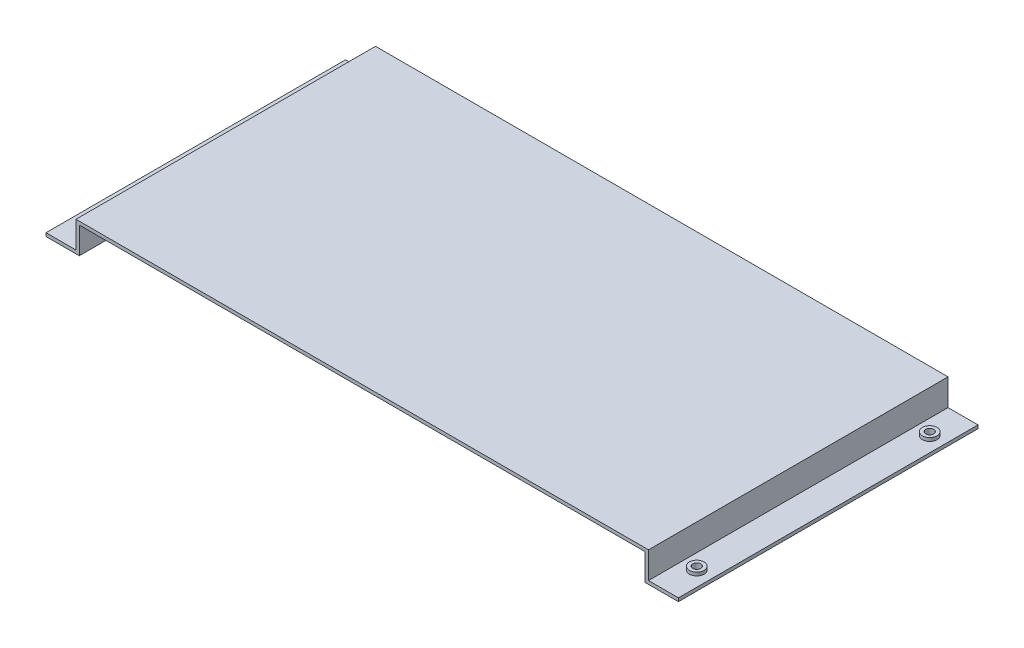
ISO-10303-21;
HEADER;
FILE_DESCRIPTION(('STEP AP214'),'2;1');
FILE_NAME('part.step','',(''),(''),'','','');
FILE_SCHEMA(('AUTOMOTIVE_DESIGN { 1 0 10303 214 1 1 1 1 }'));
ENDSEC;
DATA;
#1=APPLICATION_CONTEXT('core data for automotive mechanical design processes');
#2=APPLICATION_PROTOCOL_DEFINITION('international standard','automotive_design',2000,#1);
#3=PRODUCT_CONTEXT('',#1,'mechanical');
#4=PRODUCT('Part','Part','',(#3));
#5=PRODUCT_RELATED_PRODUCT_CATEGORY('part','',(#4));
#6=PRODUCT_DEFINITION_FORMATION('','',#4);
#7=PRODUCT_DEFINITION_CONTEXT('part definition',#1,'design');
#8=PRODUCT_DEFINITION('design','',#6,#7);
#9=PRODUCT_DEFINITION_SHAPE('','',#8);
#10=(LENGTH_UNIT() NAMED_UNIT(*) SI_UNIT(.MILLI.,.METRE.));
#11=(NAMED_UNIT(*) PLANE_ANGLE_UNIT() SI_UNIT($,.RADIAN.));
#12=(NAMED_UNIT(*) SI_UNIT($,.STERADIAN.) SOLID_ANGLE_UNIT());
#13=UNCERTAINTY_MEASURE_WITH_UNIT(LENGTH_MEASURE(1.E-05),#10,'distance_accuracy_value','');
#14=(GEOMETRIC_REPRESENTATION_CONTEXT(3) GLOBAL_UNCERTAINTY_ASSIGNED_CONTEXT((#13)) GLOBAL_UNIT_ASSIGNED_CONTEXT((#10,
#11,#12)) REPRESENTATION_CONTEXT('',''));
#15=CARTESIAN_POINT('',(0.,0.,0.));
#16=DIRECTION('',(0.,0.,1.));
#17=DIRECTION('',(1.,0.,0.));
#18=AXIS2_PLACEMENT_3D('',#15,#16,#17);
#19=CARTESIAN_POINT('',(0.,2.,0.));
#20=DIRECTION('',(0.,1.,0.));
#21=DIRECTION('',(0.,0.,1.));
#22=AXIS2_PLACEMENT_3D('',#19,#20,#21);
#23=PLANE('',#22);
#24=CARTESIAN_POINT('',(-90.5,2.,10.));
#25=DIRECTION('',(0.,1.,0.));
#26=DIRECTION('',(0.,0.,1.));
#27=AXIS2_PLACEMENT_3D('',#24,#25,#26);
#28=CIRCLE('',#27,1.2);
#29=CARTESIAN_POINT('',(-90.5,2.,11.2));
#30=VERTEX_POINT('',#29);
#31=EDGE_CURVE('E173',#30,#30,#28,.F.);
#32=ORIENTED_EDGE('',*,*,#31,.T.);
#33=EDGE_LOOP('',(#32));
#34=FACE_BOUND('',#33,.T.);
#35=CARTESIAN_POINT('',(-90.5,2.,10.));
#36=DIRECTION('',(0.,1.,0.));
#37=DIRECTION('',(0.,0.,1.));
#38=AXIS2_PLACEMENT_3D('',#35,#36,#37);
#39=CIRCLE('',#38,2.2);
#40=CARTESIAN_POINT('',(-90.5,2.,12.2));
#41=VERTEX_POINT('',#40);
#42=EDGE_CURVE('E175',#41,#41,#39,.F.);
#43=ORIENTED_EDGE('',*,*,#42,.F.);
#44=EDGE_LOOP('',(#43));
#45=FACE_BOUND('',#44,.T.);
#46=ADVANCED_FACE('F16',(#34,#45),#23,.T.);
#47=CARTESIAN_POINT('',(0.,2.,0.));
#48=DIRECTION('',(0.,1.,0.));
#49=DIRECTION('',(0.,0.,1.));
#50=AXIS2_PLACEMENT_3D('',#47,#48,#49);
#51=PLANE('',#50);
#52=CARTESIAN_POINT('',(-90.5,2.,80.));
#53=DIRECTION('',(0.,1.,0.));
#54=DIRECTION('',(0.,0.,1.));
#55=AXIS2_PLACEMENT_3D('',#52,#53,#54);
#56=CIRCLE('',#55,1.2);
#57=CARTESIAN_POINT('',(-90.5,2.,81.2));
#58=VERTEX_POINT('',#57);
#59=EDGE_CURVE('E170',#58,#58,#56,.F.);
#60=ORIENTED_EDGE('',*,*,#59,.T.);
#61=EDGE_LOOP('',(#60));
#62=FACE_BOUND('',#61,.T.);
#63=CARTESIAN_POINT('',(-90.5,2.,80.));
#64=DIRECTION('',(0.,1.,0.));
#65=DIRECTION('',(0.,0.,1.));
#66=AXIS2_PLACEMENT_3D('',#63,#64,#65);
#67=CIRCLE('',#66,2.2);
#68=CARTESIAN_POINT('',(-90.5,2.,82.2));
#69=VERTEX_POINT('',#68);
#70=EDGE_CURVE('E202',#69,#69,#67,.F.);
#71=ORIENTED_EDGE('',*,*,#70,.F.);
#72=EDGE_LOOP('',(#71));
#73=FACE_BOUND('',#72,.T.);
#74=ADVANCED_FACE('F226',(#62,#73),#51,.T.);
#75=CARTESIAN_POINT('',(0.,2.,0.));
#76=DIRECTION('',(0.,1.,0.));
#77=DIRECTION('',(0.,0.,1.));
#78=AXIS2_PLACEMENT_3D('',#75,#76,#77);
#79=PLANE('',#78);
#80=CARTESIAN_POINT('',(90.5,2.,10.));
#81=DIRECTION('',(0.,1.,0.));
#82=DIRECTION('',(0.,0.,1.));
#83=AXIS2_PLACEMENT_3D('',#80,#81,#82);
#84=CIRCLE('',#83,1.2);
#85=CARTESIAN_POINT('',(90.5,2.,11.2));
#86=VERTEX_POINT('',#85);
#87=EDGE_CURVE('E167',#86,#86,#84,.F.);
#88=ORIENTED_EDGE('',*,*,#87,.T.);
#89=EDGE_LOOP('',(#88));
#90=FACE_BOUND('',#89,.T.);
#91=CARTESIAN_POINT('',(90.5,2.,10.));
#92=DIRECTION('',(0.,1.,0.));
#93=DIRECTION('',(0.,0.,1.));
#94=AXIS2_PLACEMENT_3D('',#91,#92,#93);
#95=CIRCLE('',#94,2.2);
#96=CARTESIAN_POINT('',(90.5,2.,12.2));
#97=VERTEX_POINT('',#96);
#98=EDGE_CURVE('E204',#97,#97,#95,.F.);
#99=ORIENTED_EDGE('',*,*,#98,.F.);
#100=EDGE_LOOP('',(#99));
#101=FACE_BOUND('',#100,.T.);
#102=ADVANCED_FACE('F216',(#90,#101),#79,.T.);
#103=CARTESIAN_POINT('',(0.,2.,0.));
#104=DIRECTION('',(0.,1.,0.));
#105=DIRECTION('',(0.,0.,1.));
#106=AXIS2_PLACEMENT_3D('',#103,#104,#105);
#107=PLANE('',#106);
#108=CARTESIAN_POINT('',(90.5,2.,80.));
#109=DIRECTION('',(0.,1.,0.));
#110=DIRECTION('',(0.,0.,1.));
#111=AXIS2_PLACEMENT_3D('',#108,#109,#110);
#112=CIRCLE('',#111,1.2);
#113=CARTESIAN_POINT('',(90.5,2.,81.2));
#114=VERTEX_POINT('',#113);
#115=EDGE_CURVE('E164',#114,#114,#112,.F.);
#116=ORIENTED_EDGE('',*,*,#115,.T.);
#117=EDGE_LOOP('',(#116));
#118=FACE_BOUND('',#117,.T.);
#119=CARTESIAN_POINT('',(90.5,2.,80.));
#120=DIRECTION('',(0.,1.,0.));
#121=DIRECTION('',(0.,0.,1.));
#122=AXIS2_PLACEMENT_3D('',#119,#120,#121);
#123=CIRCLE('',#122,2.2);
#124=CARTESIAN_POINT('',(90.5,2.,82.2));
#125=VERTEX_POINT('',#124);
#126=EDGE_CURVE('E19',#125,#125,#123,.F.);
#127=ORIENTED_EDGE('',*,*,#126,.F.);
#128=EDGE_LOOP('',(#127));
#129=FACE_BOUND('',#128,.T.);
#130=ADVANCED_FACE('F214',(#118,#129),#107,.T.);
#131=CARTESIAN_POINT('',(90.5,1.,80.));
#132=DIRECTION('',(0.,1.,0.));
#133=DIRECTION('',(0.,0.,1.));
#134=AXIS2_PLACEMENT_3D('',#131,#132,#133);
#135=CYLINDRICAL_SURFACE('',#134,2.2);
#136=ORIENTED_EDGE('',*,*,#126,.T.);
#137=EDGE_LOOP('',(#136));
#138=FACE_BOUND('',#137,.T.);
#139=CARTESIAN_POINT('',(90.5,1.,80.));
#140=DIRECTION('',(0.,1.,0.));
#141=DIRECTION('',(0.,0.,1.));
#142=AXIS2_PLACEMENT_3D('',#139,#140,#141);
#143=CIRCLE('',#142,2.2);
#144=CARTESIAN_POINT('',(90.5,1.,82.2));
#145=VERTEX_POINT('',#144);
#146=EDGE_CURVE('E163',#145,#145,#143,.F.);
#147=ORIENTED_EDGE('',*,*,#146,.F.);
#148=EDGE_LOOP('',(#147));
#149=FACE_BOUND('',#148,.T.);
#150=ADVANCED_FACE('F211',(#138,#149),#135,.T.);
#151=CARTESIAN_POINT('',(90.5,1.,10.));
#152=DIRECTION('',(0.,1.,0.));
#153=DIRECTION('',(0.,0.,1.));
#154=AXIS2_PLACEMENT_3D('',#151,#152,#153);
#155=CYLINDRICAL_SURFACE('',#154,2.2);
#156=ORIENTED_EDGE('',*,*,#98,.T.);
#157=EDGE_LOOP('',(#156));
#158=FACE_BOUND('',#157,.T.);
#159=CARTESIAN_POINT('',(90.5,1.,10.));
#160=DIRECTION('',(0.,1.,0.));
#161=DIRECTION('',(0.,0.,1.));
#162=AXIS2_PLACEMENT_3D('',#159,#160,#161);
#163=CIRCLE('',#162,2.2);
#164=CARTESIAN_POINT('',(90.5,1.,12.2));
#165=VERTEX_POINT('',#164);
#166=EDGE_CURVE('E159',#165,#165,#163,.F.);
#167=ORIENTED_EDGE('',*,*,#166,.F.);
#168=EDGE_LOOP('',(#167));
#169=FACE_BOUND('',#168,.T.);
#170=ADVANCED_FACE('F224',(#158,#169),#155,.T.);
#171=CARTESIAN_POINT('',(-90.5,1.,80.));
#172=DIRECTION('',(0.,1.,0.));
#173=DIRECTION('',(0.,0.,1.));
#174=AXIS2_PLACEMENT_3D('',#171,#172,#173);
#175=CYLINDRICAL_SURFACE('',#174,2.2);
#176=ORIENTED_EDGE('',*,*,#70,.T.);
#177=EDGE_LOOP('',(#176));
#178=FACE_BOUND('',#177,.T.);
#179=CARTESIAN_POINT('',(-90.5,1.,80.));
#180=DIRECTION('',(0.,1.,0.));
#181=DIRECTION('',(0.,0.,1.));
#182=AXIS2_PLACEMENT_3D('',#179,#180,#181);
#183=CIRCLE('',#182,2.2);
#184=CARTESIAN_POINT('',(-90.5,1.,82.2));
#185=VERTEX_POINT('',#184);
#186=EDGE_CURVE('E158',#185,#185,#183,.F.);
#187=ORIENTED_EDGE('',*,*,#186,.F.);
#188=EDGE_LOOP('',(#187));
#189=FACE_BOUND('',#188,.T.);
#190=ADVANCED_FACE('F301',(#178,#189),#175,.T.);
#191=CARTESIAN_POINT('',(-90.5,1.,10.));
#192=DIRECTION('',(0.,1.,0.));
#193=DIRECTION('',(0.,0.,1.));
#194=AXIS2_PLACEMENT_3D('',#191,#192,#193);
#195=CYLINDRICAL_SURFACE('',#194,2.2);
#196=ORIENTED_EDGE('',*,*,#42,.T.);
#197=EDGE_LOOP('',(#196));
#198=FACE_BOUND('',#197,.T.);
#199=CARTESIAN_POINT('',(-90.5,1.,10.));
#200=DIRECTION('',(0.,1.,0.));
#201=DIRECTION('',(0.,0.,1.));
#202=AXIS2_PLACEMENT_3D('',#199,#200,#201);
#203=CIRCLE('',#202,2.2);
#204=CARTESIAN_POINT('',(-90.5,1.,12.2));
#205=VERTEX_POINT('',#204);
#206=EDGE_CURVE('E156',#205,#205,#203,.F.);
#207=ORIENTED_EDGE('',*,*,#206,.F.);
#208=EDGE_LOOP('',(#207));
#209=FACE_BOUND('',#208,.T.);
#210=ADVANCED_FACE('F298',(#198,#209),#195,.T.);
#211=CARTESIAN_POINT('',(-95.,1.,0.));
#212=DIRECTION('',(-1.,0.,0.));
#213=DIRECTION('',(0.,0.,1.));
#214=AXIS2_PLACEMENT_3D('',#211,#212,#213);
#215=PLANE('',#214);
#216=DIRECTION('',(0.,0.,1.));
#217=VECTOR('',#216,1.);
#218=CARTESIAN_POINT('',(-95.,1.,0.));
#219=LINE('',#218,#217);
#220=CARTESIAN_POINT('',(-95.,1.,0.));
#221=VERTEX_POINT('',#220);
#222=CARTESIAN_POINT('',(-95.,1.,90.));
#223=VERTEX_POINT('',#222);
#224=EDGE_CURVE('E124',#221,#223,#219,.T.);
#225=ORIENTED_EDGE('',*,*,#224,.F.);
#226=DIRECTION('',(0.,1.,0.));
#227=VECTOR('',#226,1.);
#228=CARTESIAN_POINT('',(-95.,1.,0.));
#229=LINE('',#228,#227);
#230=CARTESIAN_POINT('',(-95.,0.,0.));
#231=VERTEX_POINT('',#230);
#232=EDGE_CURVE('E171',#221,#231,#229,.F.);
#233=ORIENTED_EDGE('',*,*,#232,.T.);
#234=DIRECTION('',(0.,0.,-1.));
#235=VECTOR('',#234,1.);
#236=CARTESIAN_POINT('',(-95.,0.,0.));
#237=LINE('',#236,#235);
#238=CARTESIAN_POINT('',(-95.,0.,90.));
#239=VERTEX_POINT('',#238);
#240=EDGE_CURVE('E152',#239,#231,#237,.T.);
#241=ORIENTED_EDGE('',*,*,#240,.F.);
#242=DIRECTION('',(0.,1.,0.));
#243=VECTOR('',#242,1.);
#244=CARTESIAN_POINT('',(-95.,1.,90.));
#245=LINE('',#244,#243);
#246=EDGE_CURVE('E103',#239,#223,#245,.T.);
#247=ORIENTED_EDGE('',*,*,#246,.T.);
#248=EDGE_LOOP('',(#225,#233,#241,#247));
#249=FACE_BOUND('',#248,.T.);
#250=ADVANCED_FACE('F294',(#249),#215,.T.);
#251=CARTESIAN_POINT('',(-90.5,1.,10.));
#252=DIRECTION('',(0.,1.,0.));
#253=DIRECTION('',(0.,0.,1.));
#254=AXIS2_PLACEMENT_3D('',#251,#252,#253);
#255=CYLINDRICAL_SURFACE('',#254,1.2);
#256=ORIENTED_EDGE('',*,*,#31,.F.);
#257=EDGE_LOOP('',(#256));
#258=FACE_BOUND('',#257,.T.);
#259=CARTESIAN_POINT('',(-90.5,0.,10.));
#260=DIRECTION('',(0.,1.,0.));
#261=DIRECTION('',(0.,0.,1.));
#262=AXIS2_PLACEMENT_3D('',#259,#260,#261);
#263=CIRCLE('',#262,1.2);
#264=CARTESIAN_POINT('',(-90.5,0.,11.2));
#265=VERTEX_POINT('',#264);
#266=EDGE_CURVE('E155',#265,#265,#263,.T.);
#267=ORIENTED_EDGE('',*,*,#266,.F.);
#268=EDGE_LOOP('',(#267));
#269=FACE_BOUND('',#268,.T.);
#270=ADVANCED_FACE('F290',(#258,#269),#255,.F.);
#271=CARTESIAN_POINT('',(-90.5,1.,80.));
#272=DIRECTION('',(0.,1.,0.));
#273=DIRECTION('',(0.,0.,1.));
#274=AXIS2_PLACEMENT_3D('',#271,#272,#273);
#275=CYLINDRICAL_SURFACE('',#274,1.2);
#276=ORIENTED_EDGE('',*,*,#59,.F.);
#277=EDGE_LOOP('',(#276));
#278=FACE_BOUND('',#277,.T.);
#279=CARTESIAN_POINT('',(-90.5,0.,80.));
#280=DIRECTION('',(0.,1.,0.));
#281=DIRECTION('',(0.,0.,1.));
#282=AXIS2_PLACEMENT_3D('',#279,#280,#281);
#283=CIRCLE('',#282,1.2);
#284=CARTESIAN_POINT('',(-90.5,0.,81.2));
#285=VERTEX_POINT('',#284);
#286=EDGE_CURVE('E151',#285,#285,#283,.T.);
#287=ORIENTED_EDGE('',*,*,#286,.F.);
#288=EDGE_LOOP('',(#287));
#289=FACE_BOUND('',#288,.T.);
#290=ADVANCED_FACE('F286',(#278,#289),#275,.F.);
#291=CARTESIAN_POINT('',(95.,0.,0.));
#292=DIRECTION('',(1.,0.,0.));
#293=DIRECTION('',(0.,0.,-1.));
#294=AXIS2_PLACEMENT_3D('',#291,#292,#293);
#295=PLANE('',#294);
#296=DIRECTION('',(0.,0.,-1.));
#297=VECTOR('',#296,1.);
#298=CARTESIAN_POINT('',(95.,0.,0.));
#299=LINE('',#298,#297);
#300=CARTESIAN_POINT('',(95.,0.,0.));
#301=VERTEX_POINT('',#300);
#302=CARTESIAN_POINT('',(95.,0.,90.));
#303=VERTEX_POINT('',#302);
#304=EDGE_CURVE('E139',#301,#303,#299,.F.);
#305=ORIENTED_EDGE('',*,*,#304,.F.);
#306=DIRECTION('',(0.,1.,0.));
#307=VECTOR('',#306,1.);
#308=CARTESIAN_POINT('',(95.,0.,0.));
#309=LINE('',#308,#307);
#310=CARTESIAN_POINT('',(95.,1.,0.));
#311=VERTEX_POINT('',#310);
#312=EDGE_CURVE('E165',#301,#311,#309,.T.);
#313=ORIENTED_EDGE('',*,*,#312,.T.);
#314=DIRECTION('',(0.,0.,1.));
#315=VECTOR('',#314,1.);
#316=CARTESIAN_POINT('',(95.,1.,0.));
#317=LINE('',#316,#315);
#318=CARTESIAN_POINT('',(95.,1.,90.));
#319=VERTEX_POINT('',#318);
#320=EDGE_CURVE('E160',#319,#311,#317,.F.);
#321=ORIENTED_EDGE('',*,*,#320,.F.);
#322=DIRECTION('',(0.,1.,0.));
#323=VECTOR('',#322,1.);
#324=CARTESIAN_POINT('',(95.,0.,90.));
#325=LINE('',#324,#323);
#326=EDGE_CURVE('E168',#319,#303,#325,.F.);
#327=ORIENTED_EDGE('',*,*,#326,.T.);
#328=EDGE_LOOP('',(#305,#313,#321,#327));
#329=FACE_BOUND('',#328,.T.);
#330=ADVANCED_FACE('F282',(#329),#295,.T.);
#331=CARTESIAN_POINT('',(90.5,1.,10.));
#332=DIRECTION('',(0.,1.,0.));
#333=DIRECTION('',(0.,0.,1.));
#334=AXIS2_PLACEMENT_3D('',#331,#332,#333);
#335=CYLINDRICAL_SURFACE('',#334,1.2);
#336=ORIENTED_EDGE('',*,*,#87,.F.);
#337=EDGE_LOOP('',(#336));
#338=FACE_BOUND('',#337,.T.);
#339=CARTESIAN_POINT('',(90.5,0.,10.));
#340=DIRECTION('',(0.,1.,0.));
#341=DIRECTION('',(0.,0.,1.));
#342=AXIS2_PLACEMENT_3D('',#339,#340,#341);
#343=CIRCLE('',#342,1.2);
#344=CARTESIAN_POINT('',(90.5,0.,11.2));
#345=VERTEX_POINT('',#344);
#346=EDGE_CURVE('E138',#345,#345,#343,.T.);
#347=ORIENTED_EDGE('',*,*,#346,.F.);
#348=EDGE_LOOP('',(#347));
#349=FACE_BOUND('',#348,.T.);
#350=ADVANCED_FACE('F278',(#338,#349),#335,.F.);
#351=CARTESIAN_POINT('',(90.5,1.,80.));
#352=DIRECTION('',(0.,1.,0.));
#353=DIRECTION('',(0.,0.,1.));
#354=AXIS2_PLACEMENT_3D('',#351,#352,#353);
#355=CYLINDRICAL_SURFACE('',#354,1.2);
#356=ORIENTED_EDGE('',*,*,#115,.F.);
#357=EDGE_LOOP('',(#356));
#358=FACE_BOUND('',#357,.T.);
#359=CARTESIAN_POINT('',(90.5,0.,80.));
#360=DIRECTION('',(0.,1.,0.));
#361=DIRECTION('',(0.,0.,1.));
#362=AXIS2_PLACEMENT_3D('',#359,#360,#361);
#363=CIRCLE('',#362,1.2);
#364=CARTESIAN_POINT('',(90.5,0.,81.2));
#365=VERTEX_POINT('',#364);
#366=EDGE_CURVE('E119',#365,#365,#363,.T.);
#367=ORIENTED_EDGE('',*,*,#366,.F.);
#368=EDGE_LOOP('',(#367));
#369=FACE_BOUND('',#368,.T.);
#370=ADVANCED_FACE('F274',(#358,#369),#355,.F.);
#371=CARTESIAN_POINT('',(95.,1.,0.));
#372=DIRECTION('',(0.,1.,0.));
#373=DIRECTION('',(0.,0.,1.));
#374=AXIS2_PLACEMENT_3D('',#371,#372,#373);
#375=PLANE('',#374);
#376=ORIENTED_EDGE('',*,*,#166,.T.);
#377=EDGE_LOOP('',(#376));
#378=FACE_BOUND('',#377,.T.);
#379=ORIENTED_EDGE('',*,*,#146,.T.);
#380=EDGE_LOOP('',(#379));
#381=FACE_BOUND('',#380,.T.);
#382=ORIENTED_EDGE('',*,*,#320,.T.);
#383=DIRECTION('',(1.,0.,0.));
#384=VECTOR('',#383,1.);
#385=CARTESIAN_POINT('',(0.,1.,0.));
#386=LINE('',#385,#384);
#387=CARTESIAN_POINT('',(86.,1.,0.));
#388=VERTEX_POINT('',#387);
#389=EDGE_CURVE('E318',#311,#388,#386,.F.);
#390=ORIENTED_EDGE('',*,*,#389,.T.);
#391=DIRECTION('',(0.,0.,-1.));
#392=VECTOR('',#391,1.);
#393=CARTESIAN_POINT('',(86.,1.,0.));
#394=LINE('',#393,#392);
#395=CARTESIAN_POINT('',(86.,1.,90.));
#396=VERTEX_POINT('',#395);
#397=EDGE_CURVE('E322',#396,#388,#394,.T.);
#398=ORIENTED_EDGE('',*,*,#397,.F.);
#399=DIRECTION('',(1.,0.,0.));
#400=VECTOR('',#399,1.);
#401=CARTESIAN_POINT('',(0.,1.,90.));
#402=LINE('',#401,#400);
#403=EDGE_CURVE('E319',#319,#396,#402,.F.);
#404=ORIENTED_EDGE('',*,*,#403,.F.);
#405=EDGE_LOOP('',(#382,#390,#398,#404));
#406=FACE_BOUND('',#405,.T.);
#407=ADVANCED_FACE('F270',(#378,#381,#406),#375,.T.);
#408=CARTESIAN_POINT('',(-86.,1.,0.));
#409=DIRECTION('',(0.,1.,0.));
#410=DIRECTION('',(0.,0.,1.));
#411=AXIS2_PLACEMENT_3D('',#408,#409,#410);
#412=PLANE('',#411);
#413=ORIENTED_EDGE('',*,*,#206,.T.);
#414=EDGE_LOOP('',(#413));
#415=FACE_BOUND('',#414,.T.);
#416=ORIENTED_EDGE('',*,*,#186,.T.);
#417=EDGE_LOOP('',(#416));
#418=FACE_BOUND('',#417,.T.);
#419=DIRECTION('',(0.,0.,1.));
#420=VECTOR('',#419,1.);
#421=CARTESIAN_POINT('',(-86.,1.,0.));
#422=LINE('',#421,#420);
#423=CARTESIAN_POINT('',(-86.,1.,0.));
#424=VERTEX_POINT('',#423);
#425=CARTESIAN_POINT('',(-86.,1.,90.));
#426=VERTEX_POINT('',#425);
#427=EDGE_CURVE('E108',#424,#426,#422,.T.);
#428=ORIENTED_EDGE('',*,*,#427,.F.);
#429=DIRECTION('',(1.,0.,0.));
#430=VECTOR('',#429,1.);
#431=CARTESIAN_POINT('',(0.,1.,0.));
#432=LINE('',#431,#430);
#433=EDGE_CURVE('E371',#424,#221,#432,.F.);
#434=ORIENTED_EDGE('',*,*,#433,.T.);
#435=ORIENTED_EDGE('',*,*,#224,.T.);
#436=DIRECTION('',(1.,0.,0.));
#437=VECTOR('',#436,1.);
#438=CARTESIAN_POINT('',(0.,1.,90.));
#439=LINE('',#438,#437);
#440=EDGE_CURVE('E122',#426,#223,#439,.F.);
#441=ORIENTED_EDGE('',*,*,#440,.F.);
#442=EDGE_LOOP('',(#428,#434,#435,#441));
#443=FACE_BOUND('',#442,.T.);
#444=ADVANCED_FACE('F123',(#415,#418,#443),#412,.T.);
#445=CARTESIAN_POINT('',(-95.,0.,0.));
#446=DIRECTION('',(0.,-1.,0.));
#447=DIRECTION('',(0.,0.,-1.));
#448=AXIS2_PLACEMENT_3D('',#445,#446,#447);
#449=PLANE('',#448);
#450=ORIENTED_EDGE('',*,*,#286,.T.);
#451=EDGE_LOOP('',(#450));
#452=FACE_BOUND('',#451,.T.);
#453=ORIENTED_EDGE('',*,*,#266,.T.);
#454=EDGE_LOOP('',(#453));
#455=FACE_BOUND('',#454,.T.);
#456=ORIENTED_EDGE('',*,*,#240,.T.);
#457=DIRECTION('',(1.,0.,0.));
#458=VECTOR('',#457,1.);
#459=CARTESIAN_POINT('',(0.,0.,0.));
#460=LINE('',#459,#458);
#461=CARTESIAN_POINT('',(-85.,0.,0.));
#462=VERTEX_POINT('',#461);
#463=EDGE_CURVE('E348',#231,#462,#460,.T.);
#464=ORIENTED_EDGE('',*,*,#463,.T.);
#465=DIRECTION('',(0.,0.,-1.));
#466=VECTOR('',#465,1.);
#467=CARTESIAN_POINT('',(-85.,0.,0.));
#468=LINE('',#467,#466);
#469=CARTESIAN_POINT('',(-85.,0.,90.));
#470=VERTEX_POINT('',#469);
#471=EDGE_CURVE('E148',#470,#462,#468,.T.);
#472=ORIENTED_EDGE('',*,*,#471,.F.);
#473=DIRECTION('',(1.,0.,0.));
#474=VECTOR('',#473,1.);
#475=CARTESIAN_POINT('',(0.,0.,90.));
#476=LINE('',#475,#474);
#477=EDGE_CURVE('E126',#239,#470,#476,.T.);
#478=ORIENTED_EDGE('',*,*,#477,.F.);
#479=EDGE_LOOP('',(#456,#464,#472,#478));
#480=FACE_BOUND('',#479,.T.);
#481=ADVANCED_FACE('F263',(#452,#455,#480),#449,.T.);
#482=CARTESIAN_POINT('',(-85.,0.,0.));
#483=DIRECTION('',(1.,0.,0.));
#484=DIRECTION('',(0.,0.,-1.));
#485=AXIS2_PLACEMENT_3D('',#482,#483,#484);
#486=PLANE('',#485);
#487=ORIENTED_EDGE('',*,*,#471,.T.);
#488=DIRECTION('',(0.,1.,0.));
#489=VECTOR('',#488,1.);
#490=CARTESIAN_POINT('',(-85.,0.,0.));
#491=LINE('',#490,#489);
#492=CARTESIAN_POINT('',(-85.,8.,0.));
#493=VERTEX_POINT('',#492);
#494=EDGE_CURVE('E351',#462,#493,#491,.T.);
#495=ORIENTED_EDGE('',*,*,#494,.T.);
#496=DIRECTION('',(0.,0.,-1.));
#497=VECTOR('',#496,1.);
#498=CARTESIAN_POINT('',(-85.,8.,0.));
#499=LINE('',#498,#497);
#500=CARTESIAN_POINT('',(-85.,8.,90.));
#501=VERTEX_POINT('',#500);
#502=EDGE_CURVE('E145',#501,#493,#499,.T.);
#503=ORIENTED_EDGE('',*,*,#502,.F.);
#504=DIRECTION('',(0.,1.,0.));
#505=VECTOR('',#504,1.);
#506=CARTESIAN_POINT('',(-85.,0.,90.));
#507=LINE('',#506,#505);
#508=EDGE_CURVE('E341',#470,#501,#507,.T.);
#509=ORIENTED_EDGE('',*,*,#508,.F.);
#510=EDGE_LOOP('',(#487,#495,#503,#509));
#511=FACE_BOUND('',#510,.T.);
#512=ADVANCED_FACE('F259',(#511),#486,.T.);
#513=CARTESIAN_POINT('',(-85.,8.,0.));
#514=DIRECTION('',(0.,-1.,0.));
#515=DIRECTION('',(0.,0.,-1.));
#516=AXIS2_PLACEMENT_3D('',#513,#514,#515);
#517=PLANE('',#516);
#518=ORIENTED_EDGE('',*,*,#502,.T.);
#519=DIRECTION('',(1.,0.,0.));
#520=VECTOR('',#519,1.);
#521=CARTESIAN_POINT('',(0.,8.,0.));
#522=LINE('',#521,#520);
#523=CARTESIAN_POINT('',(85.,8.,0.));
#524=VERTEX_POINT('',#523);
#525=EDGE_CURVE('E367',#493,#524,#522,.T.);
#526=ORIENTED_EDGE('',*,*,#525,.T.);
#527=DIRECTION('',(0.,0.,1.));
#528=VECTOR('',#527,1.);
#529=CARTESIAN_POINT('',(85.,8.,0.));
#530=LINE('',#529,#528);
#531=CARTESIAN_POINT('',(85.,8.,90.));
#532=VERTEX_POINT('',#531);
#533=EDGE_CURVE('E142',#532,#524,#530,.F.);
#534=ORIENTED_EDGE('',*,*,#533,.F.);
#535=DIRECTION('',(1.,0.,0.));
#536=VECTOR('',#535,1.);
#537=CARTESIAN_POINT('',(0.,8.,90.));
#538=LINE('',#537,#536);
#539=EDGE_CURVE('E338',#501,#532,#538,.T.);
#540=ORIENTED_EDGE('',*,*,#539,.F.);
#541=EDGE_LOOP('',(#518,#526,#534,#540));
#542=FACE_BOUND('',#541,.T.);
#543=ADVANCED_FACE('F255',(#542),#517,.T.);
#544=CARTESIAN_POINT('',(85.,8.,0.));
#545=DIRECTION('',(-1.,0.,0.));
#546=DIRECTION('',(0.,0.,1.));
#547=AXIS2_PLACEMENT_3D('',#544,#545,#546);
#548=PLANE('',#547);
#549=ORIENTED_EDGE('',*,*,#533,.T.);
#550=DIRECTION('',(0.,1.,0.));
#551=VECTOR('',#550,1.);
#552=CARTESIAN_POINT('',(85.,0.,0.));
#553=LINE('',#552,#551);
#554=CARTESIAN_POINT('',(85.,0.,0.));
#555=VERTEX_POINT('',#554);
#556=EDGE_CURVE('E356',#524,#555,#553,.F.);
#557=ORIENTED_EDGE('',*,*,#556,.T.);
#558=DIRECTION('',(0.,0.,-1.));
#559=VECTOR('',#558,1.);
#560=CARTESIAN_POINT('',(85.,0.,0.));
#561=LINE('',#560,#559);
#562=CARTESIAN_POINT('',(85.,0.,90.));
#563=VERTEX_POINT('',#562);
#564=EDGE_CURVE('E135',#563,#555,#561,.T.);
#565=ORIENTED_EDGE('',*,*,#564,.F.);
#566=DIRECTION('',(0.,1.,0.));
#567=VECTOR('',#566,1.);
#568=CARTESIAN_POINT('',(85.,0.,90.));
#569=LINE('',#568,#567);
#570=EDGE_CURVE('E335',#532,#563,#569,.F.);
#571=ORIENTED_EDGE('',*,*,#570,.F.);
#572=EDGE_LOOP('',(#549,#557,#565,#571));
#573=FACE_BOUND('',#572,.T.);
#574=ADVANCED_FACE('F251',(#573),#548,.T.);
#575=CARTESIAN_POINT('',(85.,0.,0.));
#576=DIRECTION('',(0.,-1.,0.));
#577=DIRECTION('',(0.,0.,-1.));
#578=AXIS2_PLACEMENT_3D('',#575,#576,#577);
#579=PLANE('',#578);
#580=ORIENTED_EDGE('',*,*,#366,.T.);
#581=EDGE_LOOP('',(#580));
#582=FACE_BOUND('',#581,.T.);
#583=ORIENTED_EDGE('',*,*,#346,.T.);
#584=EDGE_LOOP('',(#583));
#585=FACE_BOUND('',#584,.T.);
#586=ORIENTED_EDGE('',*,*,#564,.T.);
#587=DIRECTION('',(1.,0.,0.));
#588=VECTOR('',#587,1.);
#589=CARTESIAN_POINT('',(0.,0.,0.));
#590=LINE('',#589,#588);
#591=EDGE_CURVE('E359',#555,#301,#590,.T.);
#592=ORIENTED_EDGE('',*,*,#591,.T.);
#593=ORIENTED_EDGE('',*,*,#304,.T.);
#594=DIRECTION('',(1.,0.,0.));
#595=VECTOR('',#594,1.);
#596=CARTESIAN_POINT('',(0.,0.,90.));
#597=LINE('',#596,#595);
#598=EDGE_CURVE('E332',#563,#303,#597,.T.);
#599=ORIENTED_EDGE('',*,*,#598,.F.);
#600=EDGE_LOOP('',(#586,#592,#593,#599));
#601=FACE_BOUND('',#600,.T.);
#602=ADVANCED_FACE('F248',(#582,#585,#601),#579,.T.);
#603=CARTESIAN_POINT('',(-86.,9.,0.));
#604=DIRECTION('',(-1.,0.,0.));
#605=DIRECTION('',(0.,0.,1.));
#606=AXIS2_PLACEMENT_3D('',#603,#604,#605);
#607=PLANE('',#606);
#608=DIRECTION('',(0.,0.,1.));
#609=VECTOR('',#608,1.);
#610=CARTESIAN_POINT('',(-86.,9.,0.));
#611=LINE('',#610,#609);
#612=CARTESIAN_POINT('',(-86.,9.,0.));
#613=VERTEX_POINT('',#612);
#614=CARTESIAN_POINT('',(-86.,9.,90.));
#615=VERTEX_POINT('',#614);
#616=EDGE_CURVE('E361',#613,#615,#611,.T.);
#617=ORIENTED_EDGE('',*,*,#616,.F.);
#618=DIRECTION('',(0.,1.,0.));
#619=VECTOR('',#618,1.);
#620=CARTESIAN_POINT('',(-86.,0.,0.));
#621=LINE('',#620,#619);
#622=EDGE_CURVE('E115',#613,#424,#621,.F.);
#623=ORIENTED_EDGE('',*,*,#622,.T.);
#624=ORIENTED_EDGE('',*,*,#427,.T.);
#625=DIRECTION('',(0.,1.,0.));
#626=VECTOR('',#625,1.);
#627=CARTESIAN_POINT('',(-86.,0.,90.));
#628=LINE('',#627,#626);
#629=EDGE_CURVE('E112',#615,#426,#628,.F.);
#630=ORIENTED_EDGE('',*,*,#629,.F.);
#631=EDGE_LOOP('',(#617,#623,#624,#630));
#632=FACE_BOUND('',#631,.T.);
#633=ADVANCED_FACE('F110',(#632),#607,.T.);
#634=CARTESIAN_POINT('',(0.,0.,90.));
#635=DIRECTION('',(0.,0.,1.));
#636=DIRECTION('',(1.,0.,0.));
#637=AXIS2_PLACEMENT_3D('',#634,#635,#636);
#638=PLANE('',#637);
#639=ORIENTED_EDGE('',*,*,#326,.F.);
#640=ORIENTED_EDGE('',*,*,#403,.T.);
#641=DIRECTION('',(0.,1.,0.));
#642=VECTOR('',#641,1.);
#643=CARTESIAN_POINT('',(86.,1.,90.));
#644=LINE('',#643,#642);
#645=CARTESIAN_POINT('',(86.,9.,90.));
#646=VERTEX_POINT('',#645);
#647=EDGE_CURVE('E325',#646,#396,#644,.F.);
#648=ORIENTED_EDGE('',*,*,#647,.F.);
#649=DIRECTION('',(1.,0.,0.));
#650=VECTOR('',#649,1.);
#651=CARTESIAN_POINT('',(86.,9.,90.));
#652=LINE('',#651,#650);
#653=EDGE_CURVE('E130',#615,#646,#652,.T.);
#654=ORIENTED_EDGE('',*,*,#653,.F.);
#655=ORIENTED_EDGE('',*,*,#629,.T.);
#656=ORIENTED_EDGE('',*,*,#440,.T.);
#657=ORIENTED_EDGE('',*,*,#246,.F.);
#658=ORIENTED_EDGE('',*,*,#477,.T.);
#659=ORIENTED_EDGE('',*,*,#508,.T.);
#660=ORIENTED_EDGE('',*,*,#539,.T.);
#661=ORIENTED_EDGE('',*,*,#570,.T.);
#662=ORIENTED_EDGE('',*,*,#598,.T.);
#663=EDGE_LOOP('',(#639,#640,#648,#654,#655,#656,#657,#658,#659,#660,#661,#662));
#664=FACE_BOUND('',#663,.T.);
#665=ADVANCED_FACE('F128',(#664),#638,.T.);
#666=CARTESIAN_POINT('',(86.,1.,0.));
#667=DIRECTION('',(1.,0.,0.));
#668=DIRECTION('',(0.,0.,-1.));
#669=AXIS2_PLACEMENT_3D('',#666,#667,#668);
#670=PLANE('',#669);
#671=ORIENTED_EDGE('',*,*,#397,.T.);
#672=DIRECTION('',(0.,1.,0.));
#673=VECTOR('',#672,1.);
#674=CARTESIAN_POINT('',(86.,0.,0.));
#675=LINE('',#674,#673);
#676=CARTESIAN_POINT('',(86.,9.,0.));
#677=VERTEX_POINT('',#676);
#678=EDGE_CURVE('E34',#388,#677,#675,.T.);
#679=ORIENTED_EDGE('',*,*,#678,.T.);
#680=DIRECTION('',(0.,0.,1.));
#681=VECTOR('',#680,1.);
#682=CARTESIAN_POINT('',(86.,9.,0.));
#683=LINE('',#682,#681);
#684=EDGE_CURVE('E25',#646,#677,#683,.F.);
#685=ORIENTED_EDGE('',*,*,#684,.F.);
#686=ORIENTED_EDGE('',*,*,#647,.T.);
#687=EDGE_LOOP('',(#671,#679,#685,#686));
#688=FACE_BOUND('',#687,.T.);
#689=ADVANCED_FACE('F237',(#688),#670,.T.);
#690=CARTESIAN_POINT('',(0.,0.,0.));
#691=DIRECTION('',(0.,0.,1.));
#692=DIRECTION('',(1.,0.,0.));
#693=AXIS2_PLACEMENT_3D('',#690,#691,#692);
#694=PLANE('',#693);
#695=ORIENTED_EDGE('',*,*,#591,.F.);
#696=ORIENTED_EDGE('',*,*,#556,.F.);
#697=ORIENTED_EDGE('',*,*,#525,.F.);
#698=ORIENTED_EDGE('',*,*,#494,.F.);
#699=ORIENTED_EDGE('',*,*,#463,.F.);
#700=ORIENTED_EDGE('',*,*,#232,.F.);
#701=ORIENTED_EDGE('',*,*,#433,.F.);
#702=ORIENTED_EDGE('',*,*,#622,.F.);
#703=DIRECTION('',(1.,0.,0.));
#704=VECTOR('',#703,1.);
#705=CARTESIAN_POINT('',(86.,9.,0.));
#706=LINE('',#705,#704);
#707=EDGE_CURVE('E11',#677,#613,#706,.F.);
#708=ORIENTED_EDGE('',*,*,#707,.F.);
#709=ORIENTED_EDGE('',*,*,#678,.F.);
#710=ORIENTED_EDGE('',*,*,#389,.F.);
#711=ORIENTED_EDGE('',*,*,#312,.F.);
#712=EDGE_LOOP('',(#695,#696,#697,#698,#699,#700,#701,#702,#708,#709,#710,#711));
#713=FACE_BOUND('',#712,.T.);
#714=ADVANCED_FACE('F231',(#713),#694,.F.);
#715=CARTESIAN_POINT('',(86.,9.,0.));
#716=DIRECTION('',(0.,1.,0.));
#717=DIRECTION('',(0.,0.,1.));
#718=AXIS2_PLACEMENT_3D('',#715,#716,#717);
#719=PLANE('',#718);
#720=ORIENTED_EDGE('',*,*,#684,.T.);
#721=ORIENTED_EDGE('',*,*,#707,.T.);
#722=ORIENTED_EDGE('',*,*,#616,.T.);
#723=ORIENTED_EDGE('',*,*,#653,.T.);
#724=EDGE_LOOP('',(#720,#721,#722,#723));
#725=FACE_BOUND('',#724,.T.);
#726=ADVANCED_FACE('F229',(#725),#719,.T.);
#727=CLOSED_SHELL('',(#46,#74,#102,#130,#150,#170,#190,#210,#250,#270,#290,#330,#350,#370,#407,
#444,#481,#512,#543,#574,#602,#633,#665,#689,#714,#726));
#728=MANIFOLD_SOLID_BREP('B1',#727);
#729=ADVANCED_BREP_SHAPE_REPRESENTATION('',(#18,#728),#14);
#730=SHAPE_DEFINITION_REPRESENTATION(#9,#729);
ENDSEC;
END-ISO-10303-21;
